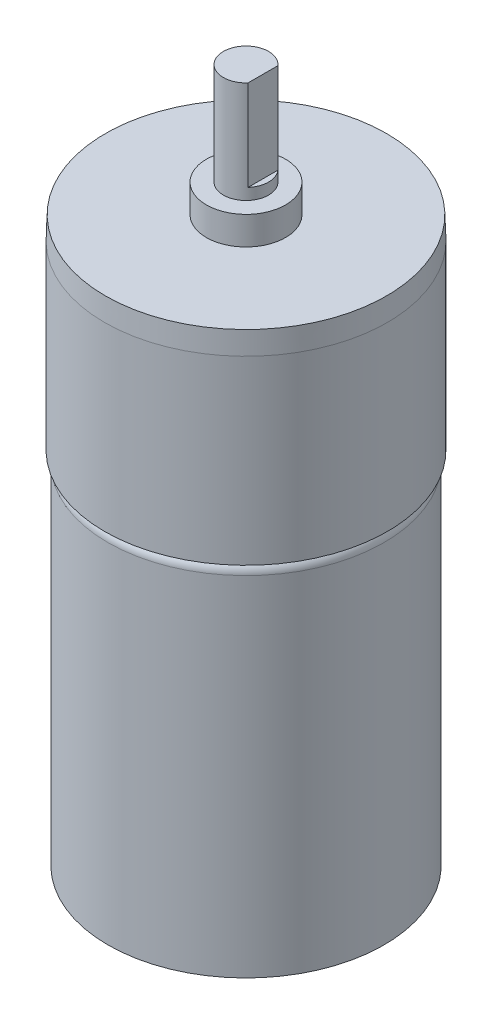
ISO-10303-21;
HEADER;
FILE_DESCRIPTION(('STEP AP214'),'2;1');
FILE_NAME('part.step','',(''),(''),'','','');
FILE_SCHEMA(('AUTOMOTIVE_DESIGN { 1 0 10303 214 1 1 1 1 }'));
ENDSEC;
DATA;
#1=APPLICATION_CONTEXT('core data for automotive mechanical design processes');
#2=APPLICATION_PROTOCOL_DEFINITION('international standard','automotive_design',2000,#1);
#3=PRODUCT_CONTEXT('',#1,'mechanical');
#4=PRODUCT('Part','Part','',(#3));
#5=PRODUCT_RELATED_PRODUCT_CATEGORY('part','',(#4));
#6=PRODUCT_DEFINITION_FORMATION('','',#4);
#7=PRODUCT_DEFINITION_CONTEXT('part definition',#1,'design');
#8=PRODUCT_DEFINITION('design','',#6,#7);
#9=PRODUCT_DEFINITION_SHAPE('','',#8);
#10=(LENGTH_UNIT() NAMED_UNIT(*) SI_UNIT(.MILLI.,.METRE.));
#11=(NAMED_UNIT(*) PLANE_ANGLE_UNIT() SI_UNIT($,.RADIAN.));
#12=(NAMED_UNIT(*) SI_UNIT($,.STERADIAN.) SOLID_ANGLE_UNIT());
#13=UNCERTAINTY_MEASURE_WITH_UNIT(LENGTH_MEASURE(1.E-05),#10,'distance_accuracy_value','');
#14=(GEOMETRIC_REPRESENTATION_CONTEXT(3) GLOBAL_UNCERTAINTY_ASSIGNED_CONTEXT((#13)) GLOBAL_UNIT_ASSIGNED_CONTEXT((#10,
#11,#12)) REPRESENTATION_CONTEXT('',''));
#15=CARTESIAN_POINT('',(0.,0.,0.));
#16=DIRECTION('',(0.,0.,1.));
#17=DIRECTION('',(1.,0.,0.));
#18=AXIS2_PLACEMENT_3D('',#15,#16,#17);
#19=CARTESIAN_POINT('',(0.,52.3,0.));
#20=DIRECTION('',(0.,1.,0.));
#21=DIRECTION('',(0.,0.,1.));
#22=AXIS2_PLACEMENT_3D('',#19,#20,#21);
#23=PLANE('',#22);
#24=CARTESIAN_POINT('',(0.,52.3,0.));
#25=DIRECTION('',(0.,1.,0.));
#26=DIRECTION('',(0.,0.,1.));
#27=AXIS2_PLACEMENT_3D('',#24,#25,#26);
#28=CIRCLE('',#27,2.);
#29=CARTESIAN_POINT('',(1.5,52.3,1.3228756555323));
#30=VERTEX_POINT('',#29);
#31=CARTESIAN_POINT('',(1.5,52.3,-1.3228756555323));
#32=VERTEX_POINT('',#31);
#33=EDGE_CURVE('E66',#30,#32,#28,.T.);
#34=ORIENTED_EDGE('',*,*,#33,.T.);
#35=DIRECTION('',(0.,0.,1.));
#36=VECTOR('',#35,1.);
#37=CARTESIAN_POINT('',(1.5,52.3,-1.3228756555323));
#38=LINE('',#37,#36);
#39=EDGE_CURVE('E70',#32,#30,#38,.T.);
#40=ORIENTED_EDGE('',*,*,#39,.T.);
#41=EDGE_LOOP('',(#34,#40));
#42=FACE_BOUND('',#41,.T.);
#43=ADVANCED_FACE('F33',(#42),#23,.T.);
#44=CARTESIAN_POINT('',(0.,51.3,0.));
#45=DIRECTION('',(0.,1.,0.));
#46=DIRECTION('',(0.,0.,1.));
#47=AXIS2_PLACEMENT_3D('',#44,#45,#46);
#48=PLANE('',#47);
#49=CARTESIAN_POINT('',(0.,51.3,0.));
#50=DIRECTION('',(0.,1.,0.));
#51=DIRECTION('',(0.,0.,1.));
#52=AXIS2_PLACEMENT_3D('',#49,#50,#51);
#53=CIRCLE('',#52,3.5);
#54=CARTESIAN_POINT('',(0.,51.3,3.5));
#55=VERTEX_POINT('',#54);
#56=EDGE_CURVE('E78',#55,#55,#53,.T.);
#57=ORIENTED_EDGE('',*,*,#56,.T.);
#58=EDGE_LOOP('',(#57));
#59=FACE_BOUND('',#58,.T.);
#60=CARTESIAN_POINT('',(0.,51.3,0.));
#61=DIRECTION('',(0.,1.,0.));
#62=DIRECTION('',(0.,0.,1.));
#63=AXIS2_PLACEMENT_3D('',#60,#61,#62);
#64=CIRCLE('',#63,2.);
#65=CARTESIAN_POINT('',(0.,51.3,2.));
#66=VERTEX_POINT('',#65);
#67=EDGE_CURVE('E75',#66,#66,#64,.T.);
#68=ORIENTED_EDGE('',*,*,#67,.F.);
#69=EDGE_LOOP('',(#68));
#70=FACE_BOUND('',#69,.T.);
#71=ADVANCED_FACE('F126',(#59,#70),#48,.T.);
#72=CARTESIAN_POINT('',(0.,48.8,0.));
#73=DIRECTION('',(0.,1.,0.));
#74=DIRECTION('',(0.,0.,1.));
#75=AXIS2_PLACEMENT_3D('',#72,#73,#74);
#76=PLANE('',#75);
#77=CARTESIAN_POINT('',(0.,48.8,0.));
#78=DIRECTION('',(0.,1.,0.));
#79=DIRECTION('',(0.,0.,1.));
#80=AXIS2_PLACEMENT_3D('',#77,#78,#79);
#81=CIRCLE('',#80,12.4301584610166);
#82=CARTESIAN_POINT('',(0.,48.8,12.4301584610166));
#83=VERTEX_POINT('',#82);
#84=EDGE_CURVE('E42',#83,#83,#81,.T.);
#85=ORIENTED_EDGE('',*,*,#84,.T.);
#86=EDGE_LOOP('',(#85));
#87=FACE_BOUND('',#86,.T.);
#88=CARTESIAN_POINT('',(0.,48.8,0.));
#89=DIRECTION('',(0.,1.,0.));
#90=DIRECTION('',(0.,0.,1.));
#91=AXIS2_PLACEMENT_3D('',#88,#89,#90);
#92=CIRCLE('',#91,3.5);
#93=CARTESIAN_POINT('',(0.,48.8,3.5));
#94=VERTEX_POINT('',#93);
#95=EDGE_CURVE('E74',#94,#94,#92,.T.);
#96=ORIENTED_EDGE('',*,*,#95,.F.);
#97=EDGE_LOOP('',(#96));
#98=FACE_BOUND('',#97,.T.);
#99=ADVANCED_FACE('F108',(#87,#98),#76,.T.);
#100=CARTESIAN_POINT('',(0.,-0.999999999999997,0.));
#101=DIRECTION('',(0.,1.,0.));
#102=DIRECTION('',(0.,0.,1.));
#103=AXIS2_PLACEMENT_3D('',#100,#101,#102);
#104=CYLINDRICAL_SURFACE('',#103,12.2);
#105=CARTESIAN_POINT('',(0.,29.8,0.));
#106=DIRECTION('',(0.,1.,0.));
#107=DIRECTION('',(0.,0.,1.));
#108=AXIS2_PLACEMENT_3D('',#105,#106,#107);
#109=CIRCLE('',#108,12.2);
#110=CARTESIAN_POINT('',(0.,29.8,12.2));
#111=VERTEX_POINT('',#110);
#112=EDGE_CURVE('E103',#111,#111,#109,.F.);
#113=ORIENTED_EDGE('',*,*,#112,.T.);
#114=EDGE_LOOP('',(#113));
#115=FACE_BOUND('',#114,.T.);
#116=CARTESIAN_POINT('',(0.,-0.999999999999997,0.));
#117=DIRECTION('',(0.,1.,0.));
#118=DIRECTION('',(0.,0.,1.));
#119=AXIS2_PLACEMENT_3D('',#116,#117,#118);
#120=CIRCLE('',#119,12.2);
#121=CARTESIAN_POINT('',(0.,-0.999999999999997,12.2));
#122=VERTEX_POINT('',#121);
#123=EDGE_CURVE('E97',#122,#122,#120,.T.);
#124=ORIENTED_EDGE('',*,*,#123,.T.);
#125=EDGE_LOOP('',(#124));
#126=FACE_BOUND('',#125,.T.);
#127=ADVANCED_FACE('F139',(#115,#126),#104,.T.);
#128=CARTESIAN_POINT('',(0.,-0.999999999999997,0.));
#129=DIRECTION('',(0.,1.,0.));
#130=DIRECTION('',(0.,0.,1.));
#131=AXIS2_PLACEMENT_3D('',#128,#129,#130);
#132=PLANE('',#131);
#133=ORIENTED_EDGE('',*,*,#123,.F.);
#134=EDGE_LOOP('',(#133));
#135=FACE_BOUND('',#134,.T.);
#136=ADVANCED_FACE('F145',(#135),#132,.F.);
#137=CARTESIAN_POINT('',(0.,29.8,0.));
#138=DIRECTION('',(0.,1.,0.));
#139=DIRECTION('',(0.,0.,1.));
#140=AXIS2_PLACEMENT_3D('',#137,#138,#139);
#141=TOROIDAL_SURFACE('',#140,11.2,1.);
#142=ORIENTED_EDGE('',*,*,#112,.F.);
#143=EDGE_LOOP('',(#142));
#144=FACE_BOUND('',#143,.T.);
#145=CARTESIAN_POINT('',(0.,30.8,0.));
#146=DIRECTION('',(0.,1.,0.));
#147=DIRECTION('',(0.,0.,1.));
#148=AXIS2_PLACEMENT_3D('',#145,#146,#147);
#149=CIRCLE('',#148,11.2);
#150=CARTESIAN_POINT('',(0.,30.8,11.2));
#151=VERTEX_POINT('',#150);
#152=EDGE_CURVE('E100',#151,#151,#149,.T.);
#153=ORIENTED_EDGE('',*,*,#152,.F.);
#154=EDGE_LOOP('',(#153));
#155=FACE_BOUND('',#154,.T.);
#156=ADVANCED_FACE('F143',(#144,#155),#141,.T.);
#157=CARTESIAN_POINT('',(0.,48.8,0.));
#158=DIRECTION('',(0.,-1.,0.));
#159=DIRECTION('',(0.,0.,-1.));
#160=AXIS2_PLACEMENT_3D('',#157,#158,#159);
#161=CYLINDRICAL_SURFACE('',#160,12.5);
#162=CARTESIAN_POINT('',(0.,46.8000000000034,0.));
#163=DIRECTION('',(0.,1.,0.));
#164=DIRECTION('',(0.,0.,1.));
#165=AXIS2_PLACEMENT_3D('',#162,#163,#164);
#166=CIRCLE('',#165,12.5);
#167=CARTESIAN_POINT('',(0.,46.8000000000034,12.5));
#168=VERTEX_POINT('',#167);
#169=EDGE_CURVE('E11',#168,#168,#166,.F.);
#170=ORIENTED_EDGE('',*,*,#169,.T.);
#171=EDGE_LOOP('',(#170));
#172=FACE_BOUND('',#171,.T.);
#173=CARTESIAN_POINT('',(0.,30.8,0.));
#174=DIRECTION('',(0.,1.,0.));
#175=DIRECTION('',(0.,0.,1.));
#176=AXIS2_PLACEMENT_3D('',#173,#174,#175);
#177=CIRCLE('',#176,12.5);
#178=CARTESIAN_POINT('',(0.,30.8,12.5));
#179=VERTEX_POINT('',#178);
#180=EDGE_CURVE('E93',#179,#179,#177,.T.);
#181=ORIENTED_EDGE('',*,*,#180,.T.);
#182=EDGE_LOOP('',(#181));
#183=FACE_BOUND('',#182,.T.);
#184=ADVANCED_FACE('F121',(#172,#183),#161,.T.);
#185=CARTESIAN_POINT('',(0.,30.8,0.));
#186=DIRECTION('',(0.,1.,0.));
#187=DIRECTION('',(0.,0.,1.));
#188=AXIS2_PLACEMENT_3D('',#185,#186,#187);
#189=PLANE('',#188);
#190=ORIENTED_EDGE('',*,*,#152,.T.);
#191=EDGE_LOOP('',(#190));
#192=FACE_BOUND('',#191,.T.);
#193=ORIENTED_EDGE('',*,*,#180,.F.);
#194=EDGE_LOOP('',(#193));
#195=FACE_BOUND('',#194,.T.);
#196=ADVANCED_FACE('F113',(#192,#195),#189,.F.);
#197=CARTESIAN_POINT('',(0.,48.8,0.));
#198=DIRECTION('',(0.,-1.,0.));
#199=DIRECTION('',(0.,0.,-1.));
#200=AXIS2_PLACEMENT_3D('',#197,#198,#199);
#201=CONICAL_SURFACE('',#200,12.4301584610166,0.0349065850398829);
#202=ORIENTED_EDGE('',*,*,#169,.F.);
#203=EDGE_LOOP('',(#202));
#204=FACE_BOUND('',#203,.T.);
#205=ORIENTED_EDGE('',*,*,#84,.F.);
#206=EDGE_LOOP('',(#205));
#207=FACE_BOUND('',#206,.T.);
#208=ADVANCED_FACE('F35',(#204,#207),#201,.T.);
#209=CARTESIAN_POINT('',(0.,51.3,0.));
#210=DIRECTION('',(0.,-1.,0.));
#211=DIRECTION('',(0.,0.,-1.));
#212=AXIS2_PLACEMENT_3D('',#209,#210,#211);
#213=CYLINDRICAL_SURFACE('',#212,3.5);
#214=ORIENTED_EDGE('',*,*,#56,.F.);
#215=EDGE_LOOP('',(#214));
#216=FACE_BOUND('',#215,.T.);
#217=ORIENTED_EDGE('',*,*,#95,.T.);
#218=EDGE_LOOP('',(#217));
#219=FACE_BOUND('',#218,.T.);
#220=ADVANCED_FACE('F112',(#216,#219),#213,.T.);
#221=CARTESIAN_POINT('',(0.,52.3,0.));
#222=DIRECTION('',(0.,-1.,0.));
#223=DIRECTION('',(0.,0.,-1.));
#224=AXIS2_PLACEMENT_3D('',#221,#222,#223);
#225=CYLINDRICAL_SURFACE('',#224,2.);
#226=ORIENTED_EDGE('',*,*,#33,.F.);
#227=DIRECTION('',(0.,-1.,0.));
#228=VECTOR('',#227,1.);
#229=CARTESIAN_POINT('',(1.5,60.3,1.3228756555323));
#230=LINE('',#229,#228);
#231=CARTESIAN_POINT('',(1.5,60.3,1.3228756555323));
#232=VERTEX_POINT('',#231);
#233=EDGE_CURVE('E50',#232,#30,#230,.T.);
#234=ORIENTED_EDGE('',*,*,#233,.F.);
#235=CARTESIAN_POINT('',(0.,60.3,0.));
#236=DIRECTION('',(0.,1.,0.));
#237=DIRECTION('',(0.,0.,1.));
#238=AXIS2_PLACEMENT_3D('',#235,#236,#237);
#239=CIRCLE('',#238,2.);
#240=CARTESIAN_POINT('',(1.5,60.3,-1.3228756555323));
#241=VERTEX_POINT('',#240);
#242=EDGE_CURVE('E67',#241,#232,#239,.T.);
#243=ORIENTED_EDGE('',*,*,#242,.F.);
#244=DIRECTION('',(0.,-1.,0.));
#245=VECTOR('',#244,1.);
#246=CARTESIAN_POINT('',(1.5,60.3,-1.3228756555323));
#247=LINE('',#246,#245);
#248=EDGE_CURVE('E56',#241,#32,#247,.T.);
#249=ORIENTED_EDGE('',*,*,#248,.T.);
#250=EDGE_LOOP('',(#226,#234,#243,#249));
#251=FACE_BOUND('',#250,.T.);
#252=ORIENTED_EDGE('',*,*,#67,.T.);
#253=EDGE_LOOP('',(#252));
#254=FACE_BOUND('',#253,.T.);
#255=ADVANCED_FACE('F63',(#251,#254),#225,.T.);
#256=CARTESIAN_POINT('',(1.5,60.3,-1.3228756555323));
#257=DIRECTION('',(1.,0.,0.));
#258=DIRECTION('',(0.,0.,-1.));
#259=AXIS2_PLACEMENT_3D('',#256,#257,#258);
#260=PLANE('',#259);
#261=ORIENTED_EDGE('',*,*,#39,.F.);
#262=ORIENTED_EDGE('',*,*,#248,.F.);
#263=DIRECTION('',(0.,0.,1.));
#264=VECTOR('',#263,1.);
#265=CARTESIAN_POINT('',(1.5,60.3,-1.3228756555323));
#266=LINE('',#265,#264);
#267=EDGE_CURVE('E69',#241,#232,#266,.T.);
#268=ORIENTED_EDGE('',*,*,#267,.T.);
#269=ORIENTED_EDGE('',*,*,#233,.T.);
#270=EDGE_LOOP('',(#261,#262,#268,#269));
#271=FACE_BOUND('',#270,.T.);
#272=ADVANCED_FACE('F71',(#271),#260,.T.);
#273=CARTESIAN_POINT('',(0.,60.3,0.));
#274=DIRECTION('',(0.,1.,0.));
#275=DIRECTION('',(0.,0.,1.));
#276=AXIS2_PLACEMENT_3D('',#273,#274,#275);
#277=PLANE('',#276);
#278=ORIENTED_EDGE('',*,*,#242,.T.);
#279=ORIENTED_EDGE('',*,*,#267,.F.);
#280=EDGE_LOOP('',(#278,#279));
#281=FACE_BOUND('',#280,.T.);
#282=ADVANCED_FACE('F230',(#281),#277,.T.);
#283=CLOSED_SHELL('',(#43,#71,#99,#127,#136,#156,#184,#196,#208,#220,#255,#272,#282));
#284=MANIFOLD_SOLID_BREP('B2',#283);
#285=ADVANCED_BREP_SHAPE_REPRESENTATION('',(#18,#284),#14);
#286=SHAPE_DEFINITION_REPRESENTATION(#9,#285);
ENDSEC;
END-ISO-10303-21;
